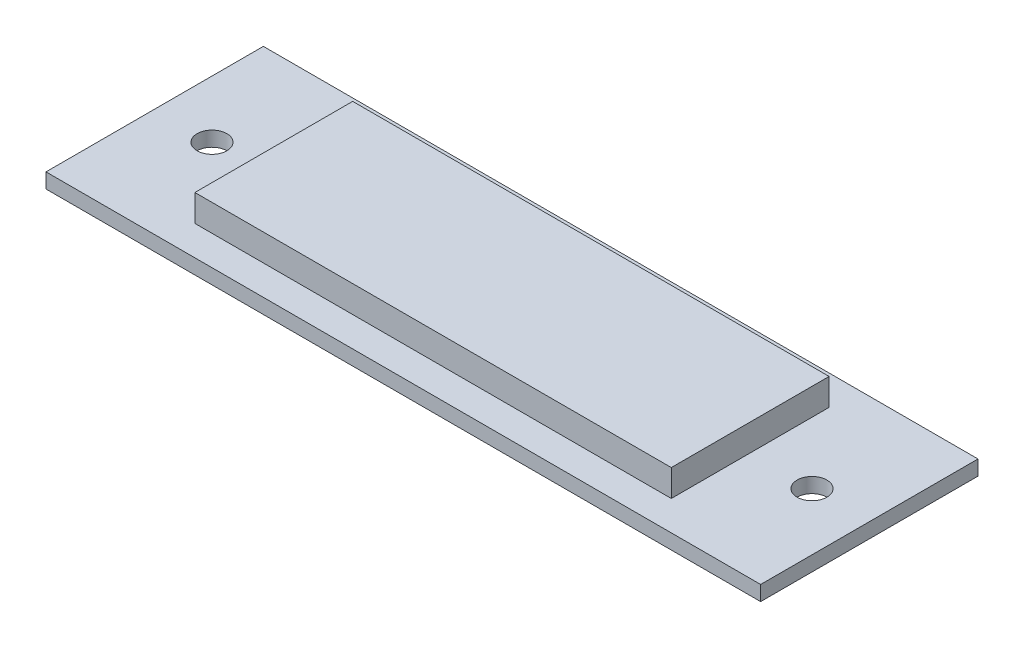
ISO-10303-21;
HEADER;
FILE_DESCRIPTION(('STEP AP214'),'2;1');
FILE_NAME('part.step','',(''),(''),'','','');
FILE_SCHEMA(('AUTOMOTIVE_DESIGN { 1 0 10303 214 1 1 1 1 }'));
ENDSEC;
DATA;
#1=APPLICATION_CONTEXT('core data for automotive mechanical design processes');
#2=APPLICATION_PROTOCOL_DEFINITION('international standard','automotive_design',2000,#1);
#3=PRODUCT_CONTEXT('',#1,'mechanical');
#4=PRODUCT('Part','Part','',(#3));
#5=PRODUCT_RELATED_PRODUCT_CATEGORY('part','',(#4));
#6=PRODUCT_DEFINITION_FORMATION('','',#4);
#7=PRODUCT_DEFINITION_CONTEXT('part definition',#1,'design');
#8=PRODUCT_DEFINITION('design','',#6,#7);
#9=PRODUCT_DEFINITION_SHAPE('','',#8);
#10=(LENGTH_UNIT() NAMED_UNIT(*) SI_UNIT(.MILLI.,.METRE.));
#11=(NAMED_UNIT(*) PLANE_ANGLE_UNIT() SI_UNIT($,.RADIAN.));
#12=(NAMED_UNIT(*) SI_UNIT($,.STERADIAN.) SOLID_ANGLE_UNIT());
#13=UNCERTAINTY_MEASURE_WITH_UNIT(LENGTH_MEASURE(1.E-05),#10,'distance_accuracy_value','');
#14=(GEOMETRIC_REPRESENTATION_CONTEXT(3) GLOBAL_UNCERTAINTY_ASSIGNED_CONTEXT((#13)) GLOBAL_UNIT_ASSIGNED_CONTEXT((#10,
#11,#12)) REPRESENTATION_CONTEXT('',''));
#15=CARTESIAN_POINT('',(0.,0.,0.));
#16=DIRECTION('',(0.,0.,1.));
#17=DIRECTION('',(1.,0.,0.));
#18=AXIS2_PLACEMENT_3D('',#15,#16,#17);
#19=CARTESIAN_POINT('',(0.,7.,0.));
#20=DIRECTION('',(1.,0.,0.));
#21=DIRECTION('',(0.,0.,-1.));
#22=AXIS2_PLACEMENT_3D('',#19,#20,#21);
#23=PLANE('',#22);
#24=DIRECTION('',(0.,-1.,0.));
#25=VECTOR('',#24,1.);
#26=CARTESIAN_POINT('',(0.,7.,-26.5));
#27=LINE('',#26,#25);
#28=CARTESIAN_POINT('',(0.,7.,-26.5));
#29=VERTEX_POINT('',#28);
#30=CARTESIAN_POINT('',(0.,2.5,-26.5));
#31=VERTEX_POINT('',#30);
#32=EDGE_CURVE('E163',#29,#31,#27,.T.);
#33=ORIENTED_EDGE('',*,*,#32,.T.);
#34=DIRECTION('',(0.,0.,1.));
#35=VECTOR('',#34,1.);
#36=CARTESIAN_POINT('',(0.,2.5,0.));
#37=LINE('',#36,#35);
#38=CARTESIAN_POINT('',(0.,2.5,0.));
#39=VERTEX_POINT('',#38);
#40=EDGE_CURVE('E145',#31,#39,#37,.T.);
#41=ORIENTED_EDGE('',*,*,#40,.T.);
#42=DIRECTION('',(0.,-1.,0.));
#43=VECTOR('',#42,1.);
#44=CARTESIAN_POINT('',(0.,7.,0.));
#45=LINE('',#44,#43);
#46=CARTESIAN_POINT('',(0.,7.,0.));
#47=VERTEX_POINT('',#46);
#48=EDGE_CURVE('E44',#47,#39,#45,.T.);
#49=ORIENTED_EDGE('',*,*,#48,.F.);
#50=DIRECTION('',(0.,0.,1.));
#51=VECTOR('',#50,1.);
#52=CARTESIAN_POINT('',(0.,7.,0.));
#53=LINE('',#52,#51);
#54=EDGE_CURVE('E154',#29,#47,#53,.T.);
#55=ORIENTED_EDGE('',*,*,#54,.F.);
#56=EDGE_LOOP('',(#33,#41,#49,#55));
#57=FACE_BOUND('',#56,.T.);
#58=ADVANCED_FACE('F37',(#57),#23,.F.);
#59=CARTESIAN_POINT('',(0.,7.,0.));
#60=DIRECTION('',(0.,0.,-1.));
#61=DIRECTION('',(-1.,0.,0.));
#62=AXIS2_PLACEMENT_3D('',#59,#60,#61);
#63=PLANE('',#62);
#64=ORIENTED_EDGE('',*,*,#48,.T.);
#65=DIRECTION('',(1.,0.,0.));
#66=VECTOR('',#65,1.);
#67=CARTESIAN_POINT('',(0.,2.5,0.));
#68=LINE('',#67,#66);
#69=CARTESIAN_POINT('',(80.,2.5,0.));
#70=VERTEX_POINT('',#69);
#71=EDGE_CURVE('E152',#39,#70,#68,.T.);
#72=ORIENTED_EDGE('',*,*,#71,.T.);
#73=DIRECTION('',(0.,-1.,0.));
#74=VECTOR('',#73,1.);
#75=CARTESIAN_POINT('',(80.,7.,0.));
#76=LINE('',#75,#74);
#77=CARTESIAN_POINT('',(80.,7.,0.));
#78=VERTEX_POINT('',#77);
#79=EDGE_CURVE('E167',#78,#70,#76,.T.);
#80=ORIENTED_EDGE('',*,*,#79,.F.);
#81=DIRECTION('',(1.,0.,0.));
#82=VECTOR('',#81,1.);
#83=CARTESIAN_POINT('',(0.,7.,0.));
#84=LINE('',#83,#82);
#85=EDGE_CURVE('E157',#47,#78,#84,.T.);
#86=ORIENTED_EDGE('',*,*,#85,.F.);
#87=EDGE_LOOP('',(#64,#72,#80,#86));
#88=FACE_BOUND('',#87,.T.);
#89=ADVANCED_FACE('F171',(#88),#63,.F.);
#90=CARTESIAN_POINT('',(80.,7.,0.));
#91=DIRECTION('',(-1.,0.,0.));
#92=DIRECTION('',(0.,0.,1.));
#93=AXIS2_PLACEMENT_3D('',#90,#91,#92);
#94=PLANE('',#93);
#95=ORIENTED_EDGE('',*,*,#79,.T.);
#96=DIRECTION('',(0.,0.,-1.));
#97=VECTOR('',#96,1.);
#98=CARTESIAN_POINT('',(80.,2.5,0.));
#99=LINE('',#98,#97);
#100=CARTESIAN_POINT('',(80.,2.5,-26.5));
#101=VERTEX_POINT('',#100);
#102=EDGE_CURVE('E51',#70,#101,#99,.T.);
#103=ORIENTED_EDGE('',*,*,#102,.T.);
#104=DIRECTION('',(0.,-1.,0.));
#105=VECTOR('',#104,1.);
#106=CARTESIAN_POINT('',(80.,7.,-26.5));
#107=LINE('',#106,#105);
#108=CARTESIAN_POINT('',(80.,7.,-26.5));
#109=VERTEX_POINT('',#108);
#110=EDGE_CURVE('E165',#109,#101,#107,.T.);
#111=ORIENTED_EDGE('',*,*,#110,.F.);
#112=DIRECTION('',(0.,0.,-1.));
#113=VECTOR('',#112,1.);
#114=CARTESIAN_POINT('',(80.,7.,0.));
#115=LINE('',#114,#113);
#116=EDGE_CURVE('E159',#78,#109,#115,.T.);
#117=ORIENTED_EDGE('',*,*,#116,.F.);
#118=EDGE_LOOP('',(#95,#103,#111,#117));
#119=FACE_BOUND('',#118,.T.);
#120=ADVANCED_FACE('F205',(#119),#94,.F.);
#121=CARTESIAN_POINT('',(0.,7.,-26.5));
#122=DIRECTION('',(0.,0.,1.));
#123=DIRECTION('',(1.,0.,0.));
#124=AXIS2_PLACEMENT_3D('',#121,#122,#123);
#125=PLANE('',#124);
#126=ORIENTED_EDGE('',*,*,#110,.T.);
#127=DIRECTION('',(-1.,0.,0.));
#128=VECTOR('',#127,1.);
#129=CARTESIAN_POINT('',(0.,2.5,-26.5));
#130=LINE('',#129,#128);
#131=EDGE_CURVE('E11',#101,#31,#130,.T.);
#132=ORIENTED_EDGE('',*,*,#131,.T.);
#133=ORIENTED_EDGE('',*,*,#32,.F.);
#134=DIRECTION('',(-1.,0.,0.));
#135=VECTOR('',#134,1.);
#136=CARTESIAN_POINT('',(0.,7.,-26.5));
#137=LINE('',#136,#135);
#138=EDGE_CURVE('E161',#109,#29,#137,.T.);
#139=ORIENTED_EDGE('',*,*,#138,.F.);
#140=EDGE_LOOP('',(#126,#132,#133,#139));
#141=FACE_BOUND('',#140,.T.);
#142=ADVANCED_FACE('F209',(#141),#125,.F.);
#143=CARTESIAN_POINT('',(0.,7.,0.));
#144=DIRECTION('',(0.,-1.,0.));
#145=DIRECTION('',(0.,0.,-1.));
#146=AXIS2_PLACEMENT_3D('',#143,#144,#145);
#147=PLANE('',#146);
#148=ORIENTED_EDGE('',*,*,#54,.T.);
#149=ORIENTED_EDGE('',*,*,#85,.T.);
#150=ORIENTED_EDGE('',*,*,#116,.T.);
#151=ORIENTED_EDGE('',*,*,#138,.T.);
#152=EDGE_LOOP('',(#148,#149,#150,#151));
#153=FACE_BOUND('',#152,.T.);
#154=ADVANCED_FACE('F214',(#153),#147,.F.);
#155=CARTESIAN_POINT('',(0.,0.,0.));
#156=DIRECTION('',(0.,-1.,0.));
#157=DIRECTION('',(0.,0.,-1.));
#158=AXIS2_PLACEMENT_3D('',#155,#156,#157);
#159=PLANE('',#158);
#160=CARTESIAN_POINT('',(-10.375,0.,-13.25));
#161=DIRECTION('',(0.,1.,0.));
#162=DIRECTION('',(0.,0.,1.));
#163=AXIS2_PLACEMENT_3D('',#160,#161,#162);
#164=CIRCLE('',#163,2.5);
#165=CARTESIAN_POINT('',(-10.375,0.,-10.75));
#166=VERTEX_POINT('',#165);
#167=EDGE_CURVE('E264',#166,#166,#164,.T.);
#168=ORIENTED_EDGE('',*,*,#167,.T.);
#169=EDGE_LOOP('',(#168));
#170=FACE_BOUND('',#169,.T.);
#171=CARTESIAN_POINT('',(90.375,0.,-13.25));
#172=DIRECTION('',(0.,1.,0.));
#173=DIRECTION('',(0.,0.,1.));
#174=AXIS2_PLACEMENT_3D('',#171,#172,#173);
#175=CIRCLE('',#174,2.5);
#176=CARTESIAN_POINT('',(90.375,0.,-10.75));
#177=VERTEX_POINT('',#176);
#178=EDGE_CURVE('E127',#177,#177,#175,.T.);
#179=ORIENTED_EDGE('',*,*,#178,.T.);
#180=EDGE_LOOP('',(#179));
#181=FACE_BOUND('',#180,.T.);
#182=DIRECTION('',(1.,0.,0.));
#183=VECTOR('',#182,1.);
#184=CARTESIAN_POINT('',(0.,0.,5.));
#185=LINE('',#184,#183);
#186=CARTESIAN_POINT('',(-20.,0.,5.));
#187=VERTEX_POINT('',#186);
#188=CARTESIAN_POINT('',(100.,0.,5.));
#189=VERTEX_POINT('',#188);
#190=EDGE_CURVE('E102',#187,#189,#185,.T.);
#191=ORIENTED_EDGE('',*,*,#190,.F.);
#192=DIRECTION('',(0.,0.,-1.));
#193=VECTOR('',#192,1.);
#194=CARTESIAN_POINT('',(-20.,0.,5.));
#195=LINE('',#194,#193);
#196=CARTESIAN_POINT('',(-20.,0.,-31.5));
#197=VERTEX_POINT('',#196);
#198=EDGE_CURVE('E137',#187,#197,#195,.T.);
#199=ORIENTED_EDGE('',*,*,#198,.T.);
#200=DIRECTION('',(1.,0.,0.));
#201=VECTOR('',#200,1.);
#202=CARTESIAN_POINT('',(0.,0.,-31.5));
#203=LINE('',#202,#201);
#204=CARTESIAN_POINT('',(100.,0.,-31.5));
#205=VERTEX_POINT('',#204);
#206=EDGE_CURVE('E117',#197,#205,#203,.T.);
#207=ORIENTED_EDGE('',*,*,#206,.T.);
#208=DIRECTION('',(0.,0.,-1.));
#209=VECTOR('',#208,1.);
#210=CARTESIAN_POINT('',(100.,0.,5.));
#211=LINE('',#210,#209);
#212=EDGE_CURVE('E115',#189,#205,#211,.T.);
#213=ORIENTED_EDGE('',*,*,#212,.F.);
#214=EDGE_LOOP('',(#191,#199,#207,#213));
#215=FACE_BOUND('',#214,.T.);
#216=ADVANCED_FACE('F116',(#170,#181,#215),#159,.T.);
#217=CARTESIAN_POINT('',(0.,0.,-31.5));
#218=DIRECTION('',(0.,0.,1.));
#219=DIRECTION('',(1.,0.,0.));
#220=AXIS2_PLACEMENT_3D('',#217,#218,#219);
#221=PLANE('',#220);
#222=ORIENTED_EDGE('',*,*,#206,.F.);
#223=DIRECTION('',(0.,1.,0.));
#224=VECTOR('',#223,1.);
#225=CARTESIAN_POINT('',(-20.,0.,-31.5));
#226=LINE('',#225,#224);
#227=CARTESIAN_POINT('',(-20.,2.5,-31.5));
#228=VERTEX_POINT('',#227);
#229=EDGE_CURVE('E139',#197,#228,#226,.T.);
#230=ORIENTED_EDGE('',*,*,#229,.T.);
#231=DIRECTION('',(-1.,0.,0.));
#232=VECTOR('',#231,1.);
#233=CARTESIAN_POINT('',(80.,2.5,-31.5));
#234=LINE('',#233,#232);
#235=CARTESIAN_POINT('',(100.,2.5,-31.5));
#236=VERTEX_POINT('',#235);
#237=EDGE_CURVE('E150',#236,#228,#234,.T.);
#238=ORIENTED_EDGE('',*,*,#237,.F.);
#239=DIRECTION('',(0.,1.,0.));
#240=VECTOR('',#239,1.);
#241=CARTESIAN_POINT('',(100.,0.,-31.5));
#242=LINE('',#241,#240);
#243=EDGE_CURVE('E121',#205,#236,#242,.T.);
#244=ORIENTED_EDGE('',*,*,#243,.F.);
#245=EDGE_LOOP('',(#222,#230,#238,#244));
#246=FACE_BOUND('',#245,.T.);
#247=ADVANCED_FACE('F181',(#246),#221,.F.);
#248=CARTESIAN_POINT('',(80.,2.5,-31.5));
#249=DIRECTION('',(0.,1.,0.));
#250=DIRECTION('',(-1.,0.,0.));
#251=AXIS2_PLACEMENT_3D('',#248,#249,#250);
#252=PLANE('',#251);
#253=CARTESIAN_POINT('',(-10.375,2.5,-13.25));
#254=DIRECTION('',(0.,1.,0.));
#255=DIRECTION('',(0.,0.,1.));
#256=AXIS2_PLACEMENT_3D('',#253,#254,#255);
#257=CIRCLE('',#256,2.5);
#258=CARTESIAN_POINT('',(-10.375,2.5,-10.75));
#259=VERTEX_POINT('',#258);
#260=EDGE_CURVE('E267',#259,#259,#257,.T.);
#261=ORIENTED_EDGE('',*,*,#260,.F.);
#262=EDGE_LOOP('',(#261));
#263=FACE_BOUND('',#262,.T.);
#264=CARTESIAN_POINT('',(90.375,2.5,-13.25));
#265=DIRECTION('',(0.,1.,0.));
#266=DIRECTION('',(0.,0.,1.));
#267=AXIS2_PLACEMENT_3D('',#264,#265,#266);
#268=CIRCLE('',#267,2.5);
#269=CARTESIAN_POINT('',(90.375,2.5,-10.75));
#270=VERTEX_POINT('',#269);
#271=EDGE_CURVE('E130',#270,#270,#268,.T.);
#272=ORIENTED_EDGE('',*,*,#271,.F.);
#273=EDGE_LOOP('',(#272));
#274=FACE_BOUND('',#273,.T.);
#275=ORIENTED_EDGE('',*,*,#40,.F.);
#276=ORIENTED_EDGE('',*,*,#131,.F.);
#277=ORIENTED_EDGE('',*,*,#102,.F.);
#278=ORIENTED_EDGE('',*,*,#71,.F.);
#279=EDGE_LOOP('',(#275,#276,#277,#278));
#280=FACE_BOUND('',#279,.T.);
#281=ORIENTED_EDGE('',*,*,#237,.T.);
#282=DIRECTION('',(0.,0.,1.));
#283=VECTOR('',#282,1.);
#284=CARTESIAN_POINT('',(-20.,2.5,-31.5));
#285=LINE('',#284,#283);
#286=CARTESIAN_POINT('',(-20.,2.5,5.));
#287=VERTEX_POINT('',#286);
#288=EDGE_CURVE('E142',#228,#287,#285,.T.);
#289=ORIENTED_EDGE('',*,*,#288,.T.);
#290=DIRECTION('',(-1.,0.,0.));
#291=VECTOR('',#290,1.);
#292=CARTESIAN_POINT('',(80.,2.5,5.));
#293=LINE('',#292,#291);
#294=CARTESIAN_POINT('',(100.,2.5,5.));
#295=VERTEX_POINT('',#294);
#296=EDGE_CURVE('E112',#295,#287,#293,.T.);
#297=ORIENTED_EDGE('',*,*,#296,.F.);
#298=DIRECTION('',(0.,0.,1.));
#299=VECTOR('',#298,1.);
#300=CARTESIAN_POINT('',(100.,2.5,-31.5));
#301=LINE('',#300,#299);
#302=EDGE_CURVE('E126',#236,#295,#301,.T.);
#303=ORIENTED_EDGE('',*,*,#302,.F.);
#304=EDGE_LOOP('',(#281,#289,#297,#303));
#305=FACE_BOUND('',#304,.T.);
#306=ADVANCED_FACE('F178',(#263,#274,#280,#305),#252,.T.);
#307=CARTESIAN_POINT('',(0.,0.,5.));
#308=DIRECTION('',(0.,0.,1.));
#309=DIRECTION('',(1.,0.,0.));
#310=AXIS2_PLACEMENT_3D('',#307,#308,#309);
#311=PLANE('',#310);
#312=ORIENTED_EDGE('',*,*,#190,.T.);
#313=DIRECTION('',(0.,-1.,0.));
#314=VECTOR('',#313,1.);
#315=CARTESIAN_POINT('',(100.,2.5,5.));
#316=LINE('',#315,#314);
#317=EDGE_CURVE('E106',#295,#189,#316,.T.);
#318=ORIENTED_EDGE('',*,*,#317,.F.);
#319=ORIENTED_EDGE('',*,*,#296,.T.);
#320=DIRECTION('',(0.,-1.,0.));
#321=VECTOR('',#320,1.);
#322=CARTESIAN_POINT('',(-20.,2.5,5.));
#323=LINE('',#322,#321);
#324=EDGE_CURVE('E108',#287,#187,#323,.T.);
#325=ORIENTED_EDGE('',*,*,#324,.T.);
#326=EDGE_LOOP('',(#312,#318,#319,#325));
#327=FACE_BOUND('',#326,.T.);
#328=ADVANCED_FACE('F104',(#327),#311,.T.);
#329=CARTESIAN_POINT('',(100.,0.,0.));
#330=DIRECTION('',(1.,0.,0.));
#331=DIRECTION('',(0.,0.,-1.));
#332=AXIS2_PLACEMENT_3D('',#329,#330,#331);
#333=PLANE('',#332);
#334=ORIENTED_EDGE('',*,*,#317,.T.);
#335=ORIENTED_EDGE('',*,*,#212,.T.);
#336=ORIENTED_EDGE('',*,*,#243,.T.);
#337=ORIENTED_EDGE('',*,*,#302,.T.);
#338=EDGE_LOOP('',(#334,#335,#336,#337));
#339=FACE_BOUND('',#338,.T.);
#340=ADVANCED_FACE('F124',(#339),#333,.T.);
#341=CARTESIAN_POINT('',(-20.,0.,0.));
#342=DIRECTION('',(1.,0.,0.));
#343=DIRECTION('',(0.,0.,-1.));
#344=AXIS2_PLACEMENT_3D('',#341,#342,#343);
#345=PLANE('',#344);
#346=ORIENTED_EDGE('',*,*,#324,.F.);
#347=ORIENTED_EDGE('',*,*,#288,.F.);
#348=ORIENTED_EDGE('',*,*,#229,.F.);
#349=ORIENTED_EDGE('',*,*,#198,.F.);
#350=EDGE_LOOP('',(#346,#347,#348,#349));
#351=FACE_BOUND('',#350,.T.);
#352=ADVANCED_FACE('F188',(#351),#345,.F.);
#353=CARTESIAN_POINT('',(90.375,2.5,-13.25));
#354=DIRECTION('',(0.,1.,0.));
#355=DIRECTION('',(0.,0.,1.));
#356=AXIS2_PLACEMENT_3D('',#353,#354,#355);
#357=CYLINDRICAL_SURFACE('',#356,2.5);
#358=ORIENTED_EDGE('',*,*,#178,.F.);
#359=EDGE_LOOP('',(#358));
#360=FACE_BOUND('',#359,.T.);
#361=ORIENTED_EDGE('',*,*,#271,.T.);
#362=EDGE_LOOP('',(#361));
#363=FACE_BOUND('',#362,.T.);
#364=ADVANCED_FACE('F190',(#360,#363),#357,.F.);
#365=CARTESIAN_POINT('',(-10.375,2.5,-13.25));
#366=DIRECTION('',(0.,1.,0.));
#367=DIRECTION('',(0.,0.,1.));
#368=AXIS2_PLACEMENT_3D('',#365,#366,#367);
#369=CYLINDRICAL_SURFACE('',#368,2.5);
#370=ORIENTED_EDGE('',*,*,#167,.F.);
#371=EDGE_LOOP('',(#370));
#372=FACE_BOUND('',#371,.T.);
#373=ORIENTED_EDGE('',*,*,#260,.T.);
#374=EDGE_LOOP('',(#373));
#375=FACE_BOUND('',#374,.T.);
#376=ADVANCED_FACE('F196',(#372,#375),#369,.F.);
#377=CLOSED_SHELL('',(#58,#89,#120,#142,#154,#216,#247,#306,#328,#340,#352,#364,#376));
#378=MANIFOLD_SOLID_BREP('B2',#377);
#379=ADVANCED_BREP_SHAPE_REPRESENTATION('',(#18,#378),#14);
#380=SHAPE_DEFINITION_REPRESENTATION(#9,#379);
ENDSEC;
END-ISO-10303-21;
